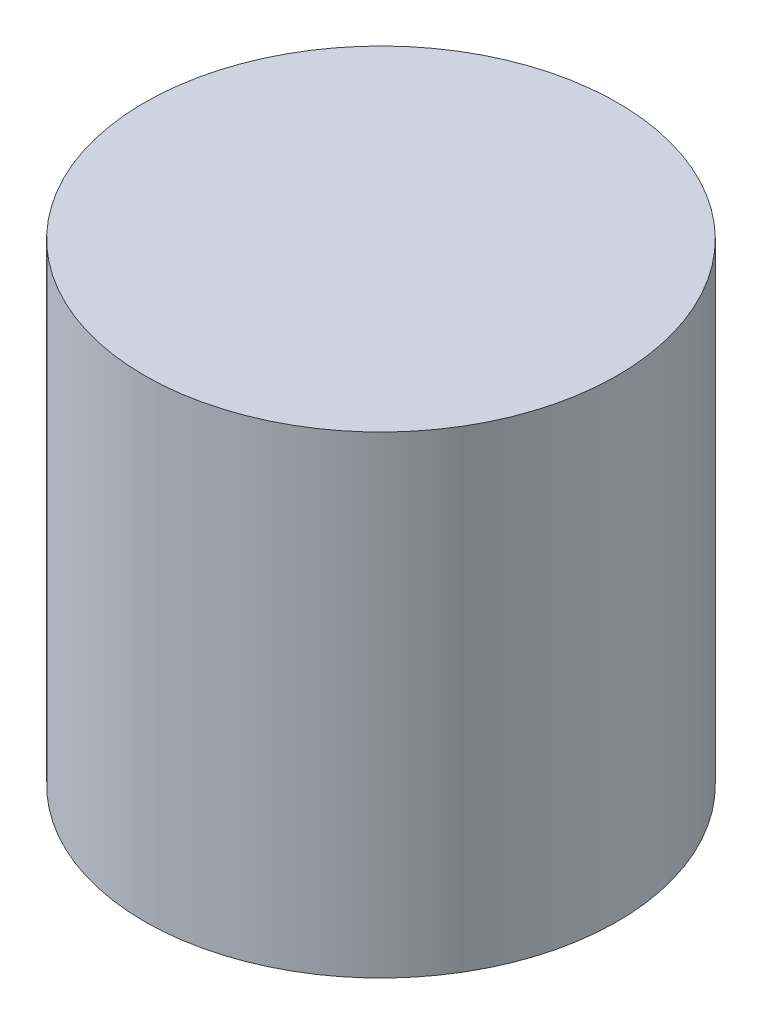
ISO-10303-21;
HEADER;
FILE_DESCRIPTION(('STEP AP214'),'2;1');
FILE_NAME('part.step','',(''),(''),'','','');
FILE_SCHEMA(('AUTOMOTIVE_DESIGN { 1 0 10303 214 1 1 1 1 }'));
ENDSEC;
DATA;
#1=APPLICATION_CONTEXT('core data for automotive mechanical design processes');
#2=APPLICATION_PROTOCOL_DEFINITION('international standard','automotive_design',2000,#1);
#3=PRODUCT_CONTEXT('',#1,'mechanical');
#4=PRODUCT('Part','Part','',(#3));
#5=PRODUCT_RELATED_PRODUCT_CATEGORY('part','',(#4));
#6=PRODUCT_DEFINITION_FORMATION('','',#4);
#7=PRODUCT_DEFINITION_CONTEXT('part definition',#1,'design');
#8=PRODUCT_DEFINITION('design','',#6,#7);
#9=PRODUCT_DEFINITION_SHAPE('','',#8);
#10=(LENGTH_UNIT() NAMED_UNIT(*) SI_UNIT(.MILLI.,.METRE.));
#11=(NAMED_UNIT(*) PLANE_ANGLE_UNIT() SI_UNIT($,.RADIAN.));
#12=(NAMED_UNIT(*) SI_UNIT($,.STERADIAN.) SOLID_ANGLE_UNIT());
#13=UNCERTAINTY_MEASURE_WITH_UNIT(LENGTH_MEASURE(1.E-05),#10,'distance_accuracy_value','');
#14=(GEOMETRIC_REPRESENTATION_CONTEXT(3) GLOBAL_UNCERTAINTY_ASSIGNED_CONTEXT((#13)) GLOBAL_UNIT_ASSIGNED_CONTEXT((#10,
#11,#12)) REPRESENTATION_CONTEXT('',''));
#15=CARTESIAN_POINT('',(0.,0.,0.));
#16=DIRECTION('',(0.,0.,1.));
#17=DIRECTION('',(1.,0.,0.));
#18=AXIS2_PLACEMENT_3D('',#15,#16,#17);
#19=CARTESIAN_POINT('',(-46.1015100878145,127.,-11.4537913261651));
#20=DIRECTION('',(0.,-1.,0.));
#21=DIRECTION('',(0.,0.,-1.));
#22=AXIS2_PLACEMENT_3D('',#19,#20,#21);
#23=CYLINDRICAL_SURFACE('',#22,63.5);
#24=CARTESIAN_POINT('',(-46.1015100878145,127.,-11.4537913261651));
#25=DIRECTION('',(0.,1.,0.));
#26=DIRECTION('',(0.,0.,1.));
#27=AXIS2_PLACEMENT_3D('',#24,#25,#26);
#28=CIRCLE('',#27,63.5);
#29=CARTESIAN_POINT('',(-46.1015100878145,127.,52.0462086738349));
#30=VERTEX_POINT('',#29);
#31=EDGE_CURVE('E10',#30,#30,#28,.T.);
#32=ORIENTED_EDGE('',*,*,#31,.F.);
#33=EDGE_LOOP('',(#32));
#34=FACE_BOUND('',#33,.T.);
#35=CARTESIAN_POINT('',(-46.1015100878145,0.,-11.4537913261651));
#36=DIRECTION('',(0.,1.,0.));
#37=DIRECTION('',(0.,0.,1.));
#38=AXIS2_PLACEMENT_3D('',#35,#36,#37);
#39=CIRCLE('',#38,63.5);
#40=CARTESIAN_POINT('',(-46.1015100878145,0.,52.0462086738349));
#41=VERTEX_POINT('',#40);
#42=EDGE_CURVE('E40',#41,#41,#39,.T.);
#43=ORIENTED_EDGE('',*,*,#42,.T.);
#44=EDGE_LOOP('',(#43));
#45=FACE_BOUND('',#44,.T.);
#46=ADVANCED_FACE('F37',(#34,#45),#23,.T.);
#47=CARTESIAN_POINT('',(-46.1015100878145,127.,-11.4537913261651));
#48=DIRECTION('',(0.,1.,0.));
#49=DIRECTION('',(0.,0.,1.));
#50=AXIS2_PLACEMENT_3D('',#47,#48,#49);
#51=PLANE('',#50);
#52=ORIENTED_EDGE('',*,*,#31,.T.);
#53=EDGE_LOOP('',(#52));
#54=FACE_BOUND('',#53,.T.);
#55=ADVANCED_FACE('F54',(#54),#51,.T.);
#56=CARTESIAN_POINT('',(-46.1015100878145,0.,-11.4537913261651));
#57=DIRECTION('',(0.,1.,0.));
#58=DIRECTION('',(0.,0.,1.));
#59=AXIS2_PLACEMENT_3D('',#56,#57,#58);
#60=PLANE('',#59);
#61=ORIENTED_EDGE('',*,*,#42,.F.);
#62=EDGE_LOOP('',(#61));
#63=FACE_BOUND('',#62,.T.);
#64=ADVANCED_FACE('F52',(#63),#60,.F.);
#65=CLOSED_SHELL('',(#46,#55,#64));
#66=MANIFOLD_SOLID_BREP('B2',#65);
#67=ADVANCED_BREP_SHAPE_REPRESENTATION('',(#18,#66),#14);
#68=SHAPE_DEFINITION_REPRESENTATION(#9,#67);
ENDSEC;
END-ISO-10303-21;
